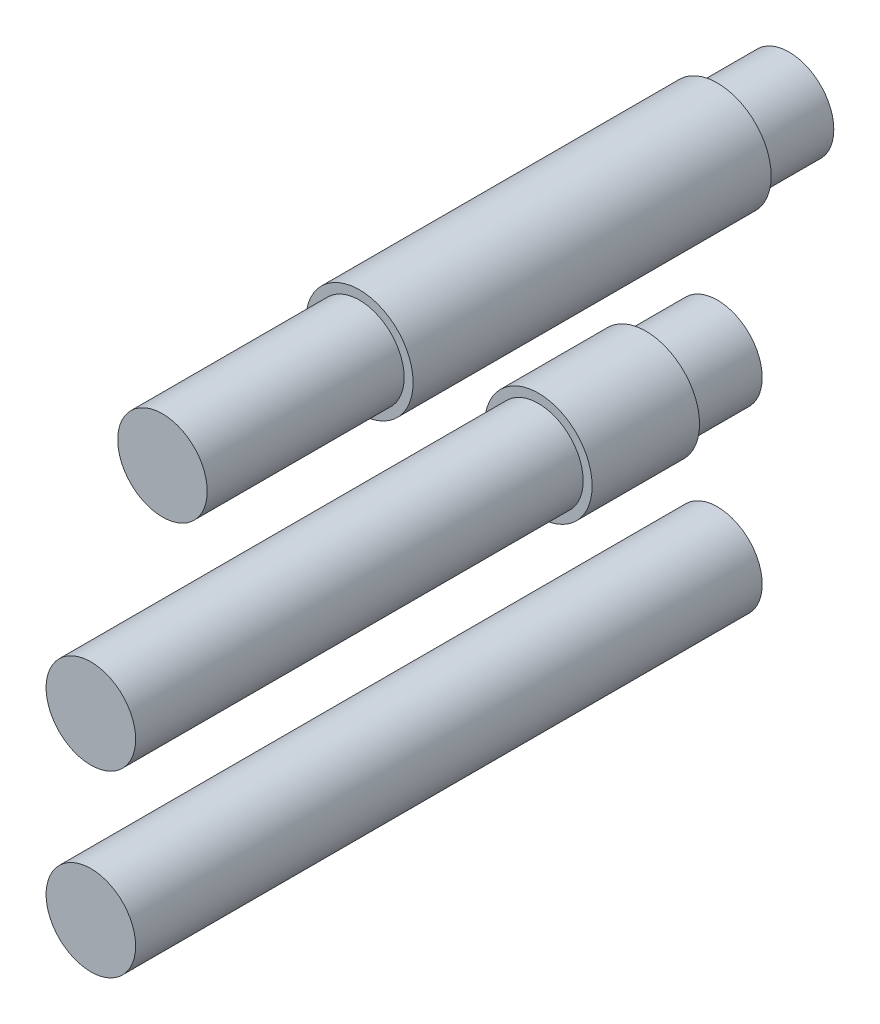
ISO-10303-21;
HEADER;
FILE_DESCRIPTION(('STEP AP214'),'2;1');
FILE_NAME('part.step','',(''),(''),'','','');
FILE_SCHEMA(('AUTOMOTIVE_DESIGN { 1 0 10303 214 1 1 1 1 }'));
ENDSEC;
DATA;
#1=APPLICATION_CONTEXT('core data for automotive mechanical design processes');
#2=APPLICATION_PROTOCOL_DEFINITION('international standard','automotive_design',2000,#1);
#3=PRODUCT_CONTEXT('',#1,'mechanical');
#4=PRODUCT('Part','Part','',(#3));
#5=PRODUCT_RELATED_PRODUCT_CATEGORY('part','',(#4));
#6=PRODUCT_DEFINITION_FORMATION('','',#4);
#7=PRODUCT_DEFINITION_CONTEXT('part definition',#1,'design');
#8=PRODUCT_DEFINITION('design','',#6,#7);
#9=PRODUCT_DEFINITION_SHAPE('','',#8);
#10=(LENGTH_UNIT() NAMED_UNIT(*) SI_UNIT(.MILLI.,.METRE.));
#11=(NAMED_UNIT(*) PLANE_ANGLE_UNIT() SI_UNIT($,.RADIAN.));
#12=(NAMED_UNIT(*) SI_UNIT($,.STERADIAN.) SOLID_ANGLE_UNIT());
#13=UNCERTAINTY_MEASURE_WITH_UNIT(LENGTH_MEASURE(1.E-05),#10,'distance_accuracy_value','');
#14=(GEOMETRIC_REPRESENTATION_CONTEXT(3) GLOBAL_UNCERTAINTY_ASSIGNED_CONTEXT((#13)) GLOBAL_UNIT_ASSIGNED_CONTEXT((#10,
#11,#12)) REPRESENTATION_CONTEXT('',''));
#15=CARTESIAN_POINT('',(0.,0.,0.));
#16=DIRECTION('',(0.,0.,1.));
#17=DIRECTION('',(1.,0.,0.));
#18=AXIS2_PLACEMENT_3D('',#15,#16,#17);
#19=CARTESIAN_POINT('',(-0.754523070476418,0.792466100807134,-3.));
#20=DIRECTION('',(0.,0.,1.));
#21=DIRECTION('',(1.,0.,0.));
#22=AXIS2_PLACEMENT_3D('',#19,#20,#21);
#23=CYLINDRICAL_SURFACE('',#22,1.5);
#24=CARTESIAN_POINT('',(-0.754523070476418,0.792466100807134,-3.));
#25=DIRECTION('',(0.,0.,1.));
#26=DIRECTION('',(1.,0.,0.));
#27=AXIS2_PLACEMENT_3D('',#24,#25,#26);
#28=CIRCLE('',#27,1.5);
#29=CARTESIAN_POINT('',(0.745476929523583,0.792466100807134,-3.));
#30=VERTEX_POINT('',#29);
#31=EDGE_CURVE('E11',#30,#30,#28,.T.);
#32=ORIENTED_EDGE('',*,*,#31,.T.);
#33=EDGE_LOOP('',(#32));
#34=FACE_BOUND('',#33,.T.);
#35=CARTESIAN_POINT('',(-0.754523070476418,0.792466100807134,0.));
#36=DIRECTION('',(0.,0.,1.));
#37=DIRECTION('',(1.,0.,0.));
#38=AXIS2_PLACEMENT_3D('',#35,#36,#37);
#39=CIRCLE('',#38,1.5);
#40=CARTESIAN_POINT('',(0.745476929523583,0.792466100807134,0.));
#41=VERTEX_POINT('',#40);
#42=EDGE_CURVE('E47',#41,#41,#39,.T.);
#43=ORIENTED_EDGE('',*,*,#42,.F.);
#44=EDGE_LOOP('',(#43));
#45=FACE_BOUND('',#44,.T.);
#46=ADVANCED_FACE('F44',(#34,#45),#23,.T.);
#47=CARTESIAN_POINT('',(-0.754523070476418,0.792466100807134,-3.));
#48=DIRECTION('',(0.,0.,1.));
#49=DIRECTION('',(1.,0.,0.));
#50=AXIS2_PLACEMENT_3D('',#47,#48,#49);
#51=PLANE('',#50);
#52=ORIENTED_EDGE('',*,*,#31,.F.);
#53=EDGE_LOOP('',(#52));
#54=FACE_BOUND('',#53,.T.);
#55=ADVANCED_FACE('F59',(#54),#51,.F.);
#56=CARTESIAN_POINT('',(-0.754523070476418,0.792466100807134,0.));
#57=DIRECTION('',(0.,0.,1.));
#58=DIRECTION('',(1.,0.,0.));
#59=AXIS2_PLACEMENT_3D('',#56,#57,#58);
#60=PLANE('',#59);
#61=ORIENTED_EDGE('',*,*,#42,.T.);
#62=EDGE_LOOP('',(#61));
#63=FACE_BOUND('',#62,.T.);
#64=ADVANCED_FACE('F56',(#63),#60,.T.);
#65=CLOSED_SHELL('',(#46,#55,#64));
#66=MANIFOLD_SOLID_BREP('B2',#65);
#67=CARTESIAN_POINT('',(4.24547692952358,0.792466100807134,17.5));
#68=DIRECTION('',(0.,0.,-1.));
#69=DIRECTION('',(-1.,0.,0.));
#70=AXIS2_PLACEMENT_3D('',#67,#68,#69);
#71=CYLINDRICAL_SURFACE('',#70,1.25);
#72=CARTESIAN_POINT('',(4.24547692952358,0.792466100807134,17.5));
#73=DIRECTION('',(0.,0.,1.));
#74=DIRECTION('',(1.,0.,0.));
#75=AXIS2_PLACEMENT_3D('',#72,#73,#74);
#76=CIRCLE('',#75,1.25);
#77=CARTESIAN_POINT('',(5.49547692952358,0.792466100807134,17.5));
#78=VERTEX_POINT('',#77);
#79=EDGE_CURVE('E43',#78,#78,#76,.T.);
#80=ORIENTED_EDGE('',*,*,#79,.F.);
#81=EDGE_LOOP('',(#80));
#82=FACE_BOUND('',#81,.T.);
#83=CARTESIAN_POINT('',(4.24547692952358,0.792466100807134,0.));
#84=DIRECTION('',(0.,0.,1.));
#85=DIRECTION('',(1.,0.,0.));
#86=AXIS2_PLACEMENT_3D('',#83,#84,#85);
#87=CIRCLE('',#86,1.25);
#88=CARTESIAN_POINT('',(5.49547692952358,0.792466100807134,0.));
#89=VERTEX_POINT('',#88);
#90=EDGE_CURVE('E96',#89,#89,#87,.T.);
#91=ORIENTED_EDGE('',*,*,#90,.T.);
#92=EDGE_LOOP('',(#91));
#93=FACE_BOUND('',#92,.T.);
#94=ADVANCED_FACE('F93',(#82,#93),#71,.T.);
#95=CARTESIAN_POINT('',(4.24547692952358,0.792466100807134,17.5));
#96=DIRECTION('',(0.,0.,1.));
#97=DIRECTION('',(1.,0.,0.));
#98=AXIS2_PLACEMENT_3D('',#95,#96,#97);
#99=PLANE('',#98);
#100=ORIENTED_EDGE('',*,*,#79,.T.);
#101=EDGE_LOOP('',(#100));
#102=FACE_BOUND('',#101,.T.);
#103=ADVANCED_FACE('F108',(#102),#99,.T.);
#104=CARTESIAN_POINT('',(4.24547692952358,0.792466100807134,0.));
#105=DIRECTION('',(0.,0.,1.));
#106=DIRECTION('',(1.,0.,0.));
#107=AXIS2_PLACEMENT_3D('',#104,#105,#106);
#108=PLANE('',#107);
#109=ORIENTED_EDGE('',*,*,#90,.F.);
#110=EDGE_LOOP('',(#109));
#111=FACE_BOUND('',#110,.T.);
#112=ADVANCED_FACE('F106',(#111),#108,.F.);
#113=CLOSED_SHELL('',(#94,#103,#112));
#114=MANIFOLD_SOLID_BREP('B6',#113);
#115=CARTESIAN_POINT('',(-0.754523070476418,0.792466100807134,-5.));
#116=DIRECTION('',(0.,0.,1.));
#117=DIRECTION('',(1.,0.,0.));
#118=AXIS2_PLACEMENT_3D('',#115,#116,#117);
#119=CYLINDRICAL_SURFACE('',#118,1.25);
#120=CARTESIAN_POINT('',(-0.754523070476418,0.792466100807134,-5.));
#121=DIRECTION('',(0.,0.,1.));
#122=DIRECTION('',(1.,0.,0.));
#123=AXIS2_PLACEMENT_3D('',#120,#121,#122);
#124=CIRCLE('',#123,1.25);
#125=CARTESIAN_POINT('',(0.495476929523582,0.792466100807134,-5.));
#126=VERTEX_POINT('',#125);
#127=EDGE_CURVE('E92',#126,#126,#124,.T.);
#128=ORIENTED_EDGE('',*,*,#127,.T.);
#129=EDGE_LOOP('',(#128));
#130=FACE_BOUND('',#129,.T.);
#131=CARTESIAN_POINT('',(-0.754523070476418,0.792466100807134,12.5));
#132=DIRECTION('',(0.,0.,1.));
#133=DIRECTION('',(1.,0.,0.));
#134=AXIS2_PLACEMENT_3D('',#131,#132,#133);
#135=CIRCLE('',#134,1.25);
#136=CARTESIAN_POINT('',(0.495476929523582,0.792466100807134,12.5));
#137=VERTEX_POINT('',#136);
#138=EDGE_CURVE('E147',#137,#137,#135,.T.);
#139=ORIENTED_EDGE('',*,*,#138,.F.);
#140=EDGE_LOOP('',(#139));
#141=FACE_BOUND('',#140,.T.);
#142=ADVANCED_FACE('F141',(#130,#141),#119,.T.);
#143=CARTESIAN_POINT('',(0.,0.,-5.));
#144=DIRECTION('',(0.,0.,1.));
#145=DIRECTION('',(1.,0.,0.));
#146=AXIS2_PLACEMENT_3D('',#143,#144,#145);
#147=PLANE('',#146);
#148=ORIENTED_EDGE('',*,*,#127,.F.);
#149=EDGE_LOOP('',(#148));
#150=FACE_BOUND('',#149,.T.);
#151=ADVANCED_FACE('F156',(#150),#147,.F.);
#152=CARTESIAN_POINT('',(0.,0.,12.5));
#153=DIRECTION('',(0.,0.,1.));
#154=DIRECTION('',(1.,0.,0.));
#155=AXIS2_PLACEMENT_3D('',#152,#153,#154);
#156=PLANE('',#155);
#157=ORIENTED_EDGE('',*,*,#138,.T.);
#158=EDGE_LOOP('',(#157));
#159=FACE_BOUND('',#158,.T.);
#160=ADVANCED_FACE('F153',(#159),#156,.T.);
#161=CLOSED_SHELL('',(#142,#151,#160));
#162=MANIFOLD_SOLID_BREP('B38',#161);
#163=CARTESIAN_POINT('',(-5.75452307047642,0.792466100807134,-12.));
#164=DIRECTION('',(0.,0.,1.));
#165=DIRECTION('',(1.,0.,0.));
#166=AXIS2_PLACEMENT_3D('',#163,#164,#165);
#167=CYLINDRICAL_SURFACE('',#166,1.25);
#168=CARTESIAN_POINT('',(-5.75452307047642,0.792466100807134,-12.));
#169=DIRECTION('',(0.,0.,1.));
#170=DIRECTION('',(1.,0.,0.));
#171=AXIS2_PLACEMENT_3D('',#168,#169,#170);
#172=CIRCLE('',#171,1.25);
#173=CARTESIAN_POINT('',(-4.50452307047642,0.792466100807134,-12.));
#174=VERTEX_POINT('',#173);
#175=EDGE_CURVE('E190',#174,#174,#172,.T.);
#176=ORIENTED_EDGE('',*,*,#175,.T.);
#177=EDGE_LOOP('',(#176));
#178=FACE_BOUND('',#177,.T.);
#179=CARTESIAN_POINT('',(-5.75452307047642,0.792466100807134,-10.));
#180=DIRECTION('',(0.,0.,1.));
#181=DIRECTION('',(1.,0.,0.));
#182=AXIS2_PLACEMENT_3D('',#179,#180,#181);
#183=CIRCLE('',#182,1.25);
#184=CARTESIAN_POINT('',(-4.50452307047642,0.792466100807134,-10.));
#185=VERTEX_POINT('',#184);
#186=EDGE_CURVE('E186',#185,#185,#183,.F.);
#187=ORIENTED_EDGE('',*,*,#186,.T.);
#188=EDGE_LOOP('',(#187));
#189=FACE_BOUND('',#188,.T.);
#190=ADVANCED_FACE('F182',(#178,#189),#167,.T.);
#191=CARTESIAN_POINT('',(0.,0.,-12.));
#192=DIRECTION('',(0.,0.,1.));
#193=DIRECTION('',(1.,0.,0.));
#194=AXIS2_PLACEMENT_3D('',#191,#192,#193);
#195=PLANE('',#194);
#196=ORIENTED_EDGE('',*,*,#175,.F.);
#197=EDGE_LOOP('',(#196));
#198=FACE_BOUND('',#197,.T.);
#199=ADVANCED_FACE('F222',(#198),#195,.F.);
#200=CARTESIAN_POINT('',(-5.75452307047642,0.792466100807134,-10.));
#201=DIRECTION('',(0.,0.,1.));
#202=DIRECTION('',(1.,0.,0.));
#203=AXIS2_PLACEMENT_3D('',#200,#201,#202);
#204=CYLINDRICAL_SURFACE('',#203,1.5);
#205=CARTESIAN_POINT('',(-5.75452307047642,0.792466100807134,-10.));
#206=DIRECTION('',(0.,0.,1.));
#207=DIRECTION('',(1.,0.,0.));
#208=AXIS2_PLACEMENT_3D('',#205,#206,#207);
#209=CIRCLE('',#208,1.5);
#210=CARTESIAN_POINT('',(-4.25452307047642,0.792466100807134,-10.));
#211=VERTEX_POINT('',#210);
#212=EDGE_CURVE('E202',#211,#211,#209,.T.);
#213=ORIENTED_EDGE('',*,*,#212,.T.);
#214=EDGE_LOOP('',(#213));
#215=FACE_BOUND('',#214,.T.);
#216=CARTESIAN_POINT('',(-5.75452307047642,0.792466100807134,0.));
#217=DIRECTION('',(0.,0.,1.));
#218=DIRECTION('',(1.,0.,0.));
#219=AXIS2_PLACEMENT_3D('',#216,#217,#218);
#220=CIRCLE('',#219,1.5);
#221=CARTESIAN_POINT('',(-4.25452307047642,0.792466100807134,0.));
#222=VERTEX_POINT('',#221);
#223=EDGE_CURVE('E199',#222,#222,#220,.T.);
#224=ORIENTED_EDGE('',*,*,#223,.F.);
#225=EDGE_LOOP('',(#224));
#226=FACE_BOUND('',#225,.T.);
#227=ADVANCED_FACE('F214',(#215,#226),#204,.T.);
#228=CARTESIAN_POINT('',(-5.75452307047642,0.792466100807134,-10.));
#229=DIRECTION('',(0.,0.,1.));
#230=DIRECTION('',(1.,0.,0.));
#231=AXIS2_PLACEMENT_3D('',#228,#229,#230);
#232=PLANE('',#231);
#233=ORIENTED_EDGE('',*,*,#186,.F.);
#234=EDGE_LOOP('',(#233));
#235=FACE_BOUND('',#234,.T.);
#236=ORIENTED_EDGE('',*,*,#212,.F.);
#237=EDGE_LOOP('',(#236));
#238=FACE_BOUND('',#237,.T.);
#239=ADVANCED_FACE('F210',(#235,#238),#232,.F.);
#240=CARTESIAN_POINT('',(-5.75452307047642,0.792466100807134,0.));
#241=DIRECTION('',(0.,0.,1.));
#242=DIRECTION('',(1.,0.,0.));
#243=AXIS2_PLACEMENT_3D('',#240,#241,#242);
#244=PLANE('',#243);
#245=CARTESIAN_POINT('',(-5.75452307047642,0.792466100807134,0.));
#246=DIRECTION('',(0.,0.,1.));
#247=DIRECTION('',(1.,0.,0.));
#248=AXIS2_PLACEMENT_3D('',#245,#246,#247);
#249=CIRCLE('',#248,1.25);
#250=CARTESIAN_POINT('',(-4.50452307047642,0.792466100807134,0.));
#251=VERTEX_POINT('',#250);
#252=EDGE_CURVE('E140',#251,#251,#249,.F.);
#253=ORIENTED_EDGE('',*,*,#252,.T.);
#254=EDGE_LOOP('',(#253));
#255=FACE_BOUND('',#254,.T.);
#256=ORIENTED_EDGE('',*,*,#223,.T.);
#257=EDGE_LOOP('',(#256));
#258=FACE_BOUND('',#257,.T.);
#259=ADVANCED_FACE('F213',(#255,#258),#244,.T.);
#260=CARTESIAN_POINT('',(0.,0.,5.5));
#261=DIRECTION('',(0.,0.,1.));
#262=DIRECTION('',(1.,0.,0.));
#263=AXIS2_PLACEMENT_3D('',#260,#261,#262);
#264=PLANE('',#263);
#265=CARTESIAN_POINT('',(-5.75452307047642,0.792466100807134,5.5));
#266=DIRECTION('',(0.,0.,1.));
#267=DIRECTION('',(1.,0.,0.));
#268=AXIS2_PLACEMENT_3D('',#265,#266,#267);
#269=CIRCLE('',#268,1.25);
#270=CARTESIAN_POINT('',(-4.50452307047642,0.792466100807134,5.5));
#271=VERTEX_POINT('',#270);
#272=EDGE_CURVE('E194',#271,#271,#269,.T.);
#273=ORIENTED_EDGE('',*,*,#272,.T.);
#274=EDGE_LOOP('',(#273));
#275=FACE_BOUND('',#274,.T.);
#276=ADVANCED_FACE('F220',(#275),#264,.T.);
#277=ORIENTED_EDGE('',*,*,#252,.F.);
#278=EDGE_LOOP('',(#277));
#279=FACE_BOUND('',#278,.T.);
#280=ORIENTED_EDGE('',*,*,#272,.F.);
#281=EDGE_LOOP('',(#280));
#282=FACE_BOUND('',#281,.T.);
#283=ADVANCED_FACE('F184',(#279,#282),#167,.T.);
#284=CLOSED_SHELL('',(#190,#199,#227,#239,#259,#276,#283));
#285=MANIFOLD_SOLID_BREP('B87',#284);
#286=ADVANCED_BREP_SHAPE_REPRESENTATION('',(#18,#66,#114,#162,#285),#14);
#287=SHAPE_DEFINITION_REPRESENTATION(#9,#286);
ENDSEC;
END-ISO-10303-21;
